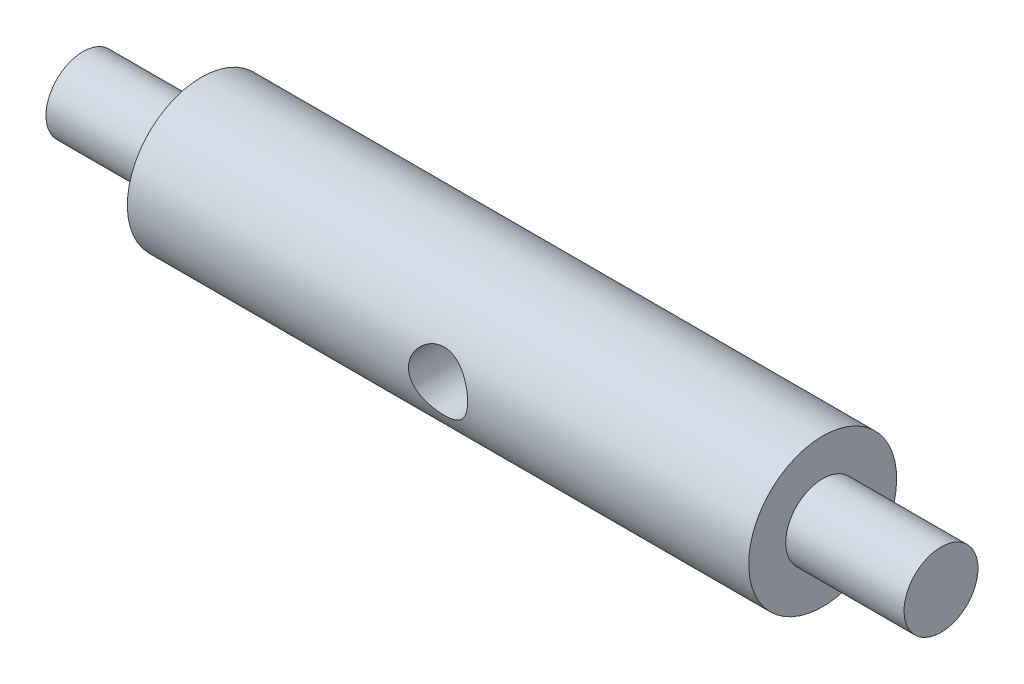
ISO-10303-21;
HEADER;
FILE_DESCRIPTION(('STEP AP214'),'2;1');
FILE_NAME('part.step','',(''),(''),'','','');
FILE_SCHEMA(('AUTOMOTIVE_DESIGN { 1 0 10303 214 1 1 1 1 }'));
ENDSEC;
DATA;
#1=APPLICATION_CONTEXT('core data for automotive mechanical design processes');
#2=APPLICATION_PROTOCOL_DEFINITION('international standard','automotive_design',2000,#1);
#3=PRODUCT_CONTEXT('',#1,'mechanical');
#4=PRODUCT('Part','Part','',(#3));
#5=PRODUCT_RELATED_PRODUCT_CATEGORY('part','',(#4));
#6=PRODUCT_DEFINITION_FORMATION('','',#4);
#7=PRODUCT_DEFINITION_CONTEXT('part definition',#1,'design');
#8=PRODUCT_DEFINITION('design','',#6,#7);
#9=PRODUCT_DEFINITION_SHAPE('','',#8);
#10=(LENGTH_UNIT() NAMED_UNIT(*) SI_UNIT(.MILLI.,.METRE.));
#11=(NAMED_UNIT(*) PLANE_ANGLE_UNIT() SI_UNIT($,.RADIAN.));
#12=(NAMED_UNIT(*) SI_UNIT($,.STERADIAN.) SOLID_ANGLE_UNIT());
#13=UNCERTAINTY_MEASURE_WITH_UNIT(LENGTH_MEASURE(1.E-05),#10,'distance_accuracy_value','');
#14=(GEOMETRIC_REPRESENTATION_CONTEXT(3) GLOBAL_UNCERTAINTY_ASSIGNED_CONTEXT((#13)) GLOBAL_UNIT_ASSIGNED_CONTEXT((#10,
#11,#12)) REPRESENTATION_CONTEXT('',''));
#15=CARTESIAN_POINT('',(0.,0.,0.));
#16=DIRECTION('',(0.,0.,1.));
#17=DIRECTION('',(1.,0.,0.));
#18=AXIS2_PLACEMENT_3D('',#15,#16,#17);
#19=CARTESIAN_POINT('',(-29.,0.,0.));
#20=DIRECTION('',(-1.,0.,0.));
#21=DIRECTION('',(0.,-1.,0.));
#22=AXIS2_PLACEMENT_3D('',#19,#20,#21);
#23=PLANE('',#22);
#24=CARTESIAN_POINT('',(-29.,0.,0.));
#25=DIRECTION('',(1.,0.,0.));
#26=DIRECTION('',(0.,1.,0.));
#27=AXIS2_PLACEMENT_3D('',#24,#25,#26);
#28=CIRCLE('',#27,2.5);
#29=CARTESIAN_POINT('',(-29.,2.5,0.));
#30=VERTEX_POINT('',#29);
#31=EDGE_CURVE('E10',#30,#30,#28,.T.);
#32=ORIENTED_EDGE('',*,*,#31,.F.);
#33=EDGE_LOOP('',(#32));
#34=FACE_BOUND('',#33,.T.);
#35=ADVANCED_FACE('F32',(#34),#23,.T.);
#36=CARTESIAN_POINT('',(29.,0.,0.));
#37=DIRECTION('',(1.,0.,0.));
#38=DIRECTION('',(0.,1.,0.));
#39=AXIS2_PLACEMENT_3D('',#36,#37,#38);
#40=CYLINDRICAL_SURFACE('',#39,2.5);
#41=ORIENTED_EDGE('',*,*,#31,.T.);
#42=EDGE_LOOP('',(#41));
#43=FACE_BOUND('',#42,.T.);
#44=CARTESIAN_POINT('',(-21.,0.,0.));
#45=DIRECTION('',(1.,0.,0.));
#46=DIRECTION('',(0.,1.,0.));
#47=AXIS2_PLACEMENT_3D('',#44,#45,#46);
#48=CIRCLE('',#47,2.5);
#49=CARTESIAN_POINT('',(-21.,2.5,0.));
#50=VERTEX_POINT('',#49);
#51=EDGE_CURVE('E43',#50,#50,#48,.T.);
#52=ORIENTED_EDGE('',*,*,#51,.F.);
#53=EDGE_LOOP('',(#52));
#54=FACE_BOUND('',#53,.T.);
#55=ADVANCED_FACE('F83',(#43,#54),#40,.T.);
#56=CARTESIAN_POINT('',(-21.,2.5,0.));
#57=DIRECTION('',(-1.,0.,0.));
#58=DIRECTION('',(0.,-1.,0.));
#59=AXIS2_PLACEMENT_3D('',#56,#57,#58);
#60=PLANE('',#59);
#61=ORIENTED_EDGE('',*,*,#51,.T.);
#62=EDGE_LOOP('',(#61));
#63=FACE_BOUND('',#62,.T.);
#64=CARTESIAN_POINT('',(-21.,0.,0.));
#65=DIRECTION('',(1.,0.,0.));
#66=DIRECTION('',(0.,1.,0.));
#67=AXIS2_PLACEMENT_3D('',#64,#65,#66);
#68=CIRCLE('',#67,5.);
#69=CARTESIAN_POINT('',(-21.,5.,0.));
#70=VERTEX_POINT('',#69);
#71=EDGE_CURVE('E48',#70,#70,#68,.T.);
#72=ORIENTED_EDGE('',*,*,#71,.F.);
#73=EDGE_LOOP('',(#72));
#74=FACE_BOUND('',#73,.T.);
#75=ADVANCED_FACE('F78',(#63,#74),#60,.T.);
#76=CARTESIAN_POINT('',(29.,0.,0.));
#77=DIRECTION('',(1.,0.,0.));
#78=DIRECTION('',(0.,1.,0.));
#79=AXIS2_PLACEMENT_3D('',#76,#77,#78);
#80=CYLINDRICAL_SURFACE('',#79,5.);
#81=CARTESIAN_POINT('',(2.,0.,-5.));
#82=CARTESIAN_POINT('',(1.99999014817627,-0.107493005442891,-4.99999271227084));
#83=CARTESIAN_POINT('',(1.99128224791162,-0.215172564090673,-4.99649294306932));
#84=CARTESIAN_POINT('',(1.95675229647876,-0.427496480417896,-4.98283453100641));
#85=CARTESIAN_POINT('',(1.93088372091387,-0.532131777561248,-4.97265778698877));
#86=CARTESIAN_POINT('',(1.86312392194117,-0.734953922727403,-4.94674209213118));
#87=CARTESIAN_POINT('',(1.82128515378327,-0.833160661616959,-4.93102136364072));
#88=CARTESIAN_POINT('',(1.72298082667345,-1.02107197032837,-4.89556610796078));
#89=CARTESIAN_POINT('',(1.66652034508107,-1.11077947675099,-4.87583297458056));
#90=CARTESIAN_POINT('',(1.53776450143906,-1.28350100757039,-4.83330886170418));
#91=CARTESIAN_POINT('',(1.46489334375974,-1.36606227255021,-4.8104229692919));
#92=CARTESIAN_POINT('',(1.30659999652322,-1.51817500478472,-4.76460576906194));
#93=CARTESIAN_POINT('',(1.22117170278826,-1.58772010713353,-4.74167444453792));
#94=CARTESIAN_POINT('',(1.03557192975773,-1.71487456729288,-4.69722791797136));
#95=CARTESIAN_POINT('',(0.934913513976802,-1.77181498119547,-4.67582115964951));
#96=CARTESIAN_POINT('',(0.724463601579957,-1.86775471903715,-4.63833647186792));
#97=CARTESIAN_POINT('',(0.614676472151639,-1.90676256428583,-4.62225601244176));
#98=CARTESIAN_POINT('',(0.394287666407897,-1.96389882339587,-4.59826357660818));
#99=CARTESIAN_POINT('',(0.283948764423786,-1.98289396580565,-4.59001420355605));
#100=CARTESIAN_POINT('',(0.0613650016927319,-2.00217296164003,-4.58164004049144));
#101=CARTESIAN_POINT('',(-0.0508788946250153,-2.00246601631322,-4.58151125522768));
#102=CARTESIAN_POINT('',(-0.265756671458044,-1.98498936750454,-4.58910500279994));
#103=CARTESIAN_POINT('',(-0.368515714409031,-1.96847531430514,-4.5962817503845));
#104=CARTESIAN_POINT('',(-0.569659556006714,-1.91994688029782,-4.61676187607836));
#105=CARTESIAN_POINT('',(-0.668043588110308,-1.88792979480463,-4.63006632321673));
#106=CARTESIAN_POINT('',(-0.860017836196042,-1.80869473255107,-4.6615948508853));
#107=CARTESIAN_POINT('',(-0.953469239054691,-1.76117986231532,-4.67991379280787));
#108=CARTESIAN_POINT('',(-1.13141581636156,-1.65250646073221,-4.7193811638989));
#109=CARTESIAN_POINT('',(-1.21590760940281,-1.59134280510084,-4.74053065456848));
#110=CARTESIAN_POINT('',(-1.380409728802,-1.45155059945443,-4.7852673674227));
#111=CARTESIAN_POINT('',(-1.45956872944602,-1.37193746297063,-4.80891664976151));
#112=CARTESIAN_POINT('',(-1.60368447800204,-1.20031442743019,-4.85459824958282));
#113=CARTESIAN_POINT('',(-1.66863839741029,-1.10830206533443,-4.87663024445324));
#114=CARTESIAN_POINT('',(-1.78361744741583,-0.912077652605842,-4.91714681264548));
#115=CARTESIAN_POINT('',(-1.83332228119705,-0.807660491346476,-4.93555270095414));
#116=CARTESIAN_POINT('',(-1.91416786107806,-0.591023765482881,-4.96614828328759));
#117=CARTESIAN_POINT('',(-1.94531803755741,-0.478808196849673,-4.97834113462382));
#118=CARTESIAN_POINT('',(-1.9864482954197,-0.256895887607819,-4.9945613950691));
#119=CARTESIAN_POINT('',(-1.99757245425356,-0.147443293985534,-4.99902945833514));
#120=CARTESIAN_POINT('',(-2.00171310052861,0.0718453098078176,-5.00068478510631));
#121=CARTESIAN_POINT('',(-1.99473428154751,0.181681213223924,-4.99787393582291));
#122=CARTESIAN_POINT('',(-1.96370824744801,0.393432739121988,-4.98557567063753));
#123=CARTESIAN_POINT('',(-1.94044201964902,0.495482491775475,-4.97639391345523));
#124=CARTESIAN_POINT('',(-1.87856429169019,0.694135428060781,-4.952594414055));
#125=CARTESIAN_POINT('',(-1.83995082033132,0.790737910224845,-4.9379759735653));
#126=CARTESIAN_POINT('',(-1.74721506032005,0.979078785816703,-4.90416594770811));
#127=CARTESIAN_POINT('',(-1.69265452795685,1.07057802275541,-4.88484815979803));
#128=CARTESIAN_POINT('',(-1.57005967609436,1.24344359124656,-4.84373364745524));
#129=CARTESIAN_POINT('',(-1.50201995707738,1.32480584076113,-4.8219359311027));
#130=CARTESIAN_POINT('',(-1.34912998705037,1.48072304302882,-4.77645117638112));
#131=CARTESIAN_POINT('',(-1.26346645849379,1.55447393380606,-4.75273441425052));
#132=CARTESIAN_POINT('',(-1.08055991699063,1.68675119741371,-4.70741672917132));
#133=CARTESIAN_POINT('',(-0.983314999660051,1.74527506133751,-4.68581615526511));
#134=CARTESIAN_POINT('',(-0.778538305405894,1.84580750193163,-4.64714299907708));
#135=CARTESIAN_POINT('',(-0.670916000787688,1.88765059453445,-4.63011630884787));
#136=CARTESIAN_POINT('',(-0.449266348284843,1.9522962197053,-4.60323673477931));
#137=CARTESIAN_POINT('',(-0.335243794187573,1.97511280526932,-4.59337855695998));
#138=CARTESIAN_POINT('',(-0.112872098225456,1.9997156172784,-4.58271759299926));
#139=CARTESIAN_POINT('',(-0.00470516040664804,2.00289708230287,-4.58131421008171));
#140=CARTESIAN_POINT('',(0.210544857713294,1.99180315927752,-4.58614836033098));
#141=CARTESIAN_POINT('',(0.317628073902585,1.97752998791378,-4.59238492324793));
#142=CARTESIAN_POINT('',(0.523332189855042,1.93307136615365,-4.6112664907902));
#143=CARTESIAN_POINT('',(0.622120274432999,1.90353749357098,-4.62364831827449));
#144=CARTESIAN_POINT('',(0.813378629613483,1.83000544849101,-4.65324001232696));
#145=CARTESIAN_POINT('',(0.905847146899827,1.78600328139381,-4.67045121206006));
#146=CARTESIAN_POINT('',(1.08760961927078,1.68187276275973,-4.70898609604491));
#147=CARTESIAN_POINT('',(1.17641867013048,1.62096533515949,-4.73048882313242));
#148=CARTESIAN_POINT('',(1.34299331720376,1.48589211927149,-4.77463804372237));
#149=CARTESIAN_POINT('',(1.42075557212832,1.41172233481812,-4.79728488048406));
#150=CARTESIAN_POINT('',(1.56820285326362,1.24650550627246,-4.84293567087394));
#151=CARTESIAN_POINT('',(1.63703730689807,1.15467600114614,-4.86586757962185));
#152=CARTESIAN_POINT('',(1.75833704262164,0.959900320285778,-4.90800406713717));
#153=CARTESIAN_POINT('',(1.81079471215253,0.856949004547236,-4.92720691092906));
#154=CARTESIAN_POINT('',(1.89662221519029,0.644738062495203,-4.95939714815861));
#155=CARTESIAN_POINT('',(1.93032932356034,0.535631618219696,-4.97249363055028));
#156=CARTESIAN_POINT('',(1.97863912095427,0.31287654628122,-4.99144306209365));
#157=CARTESIAN_POINT('',(1.9933024367439,0.199243525858912,-4.99731899495637));
#158=CARTESIAN_POINT('',(1.99939538097827,0.0569122978909289,-4.99975899504136));
#159=CARTESIAN_POINT('',(2.00000260862919,0.028462688740758,-5.00000192969175));
#160=CARTESIAN_POINT('',(2.,0.,-5.));
#161=B_SPLINE_CURVE_WITH_KNOTS('',3,(#81,#82,#83,#84,#85,#86,#87,#88,#89,#90,#91,#92,#93,#94,
#95,#96,#97,#98,#99,#100,#101,#102,#103,#104,#105,#106,#107,#108,#109,#110,#111,#112,#113,#114,
#115,#116,#117,#118,#119,#120,#121,#122,#123,#124,#125,#126,#127,#128,#129,#130,#131,#132,#133,
#134,#135,#136,#137,#138,#139,#140,#141,#142,#143,#144,#145,#146,#147,#148,#149,#150,#151,#152,
#153,#154,#155,#156,#157,#158,#159,#160),.UNSPECIFIED.,.T.,.F.,(4,2,2,2,2,2,2,2,2,2,2,2,2,2,2,2,
2,2,2,2,2,2,2,2,2,2,2,2,2,2,2,2,2,2,2,2,2,2,2,4),(0.,0.322402987893071,0.645683636007934,
0.967911457471581,1.29002753567984,1.62597381700397,1.96208394934411,2.31315258819217,
2.66405423118268,2.99904105308829,3.33386306340488,3.64538328401372,3.95695787256047,
4.27489126298816,4.59294421938183,4.93558349186557,5.27829092839733,5.62776913162806,
5.9770695611379,6.30569184528007,6.63422893570082,6.94800455564365,7.26182048993796,
7.58523513398262,7.90877959498969,8.25368474624413,8.59864669043748,8.94695045140828,
9.29499672645934,9.61799673392748,9.94095572563045,10.2511431854877,10.5614163580516,
10.8894546805669,11.2175920134839,11.5670042353384,11.9165786364053,12.2596430101332,
12.6016125240434,12.686980458968),.UNSPECIFIED.);
#162=CARTESIAN_POINT('',(2.,0.,-5.));
#163=VERTEX_POINT('',#162);
#164=EDGE_CURVE('E35',#163,#163,#161,.T.);
#165=ORIENTED_EDGE('',*,*,#164,.F.);
#166=EDGE_LOOP('',(#165));
#167=FACE_BOUND('',#166,.T.);
#168=CARTESIAN_POINT('',(2.,0.,5.));
#169=CARTESIAN_POINT('',(1.99999014817627,0.107493005442891,4.99999271227084));
#170=CARTESIAN_POINT('',(1.99128224791162,0.215172564090674,4.99649294306932));
#171=CARTESIAN_POINT('',(1.95675229647876,0.427496480417896,4.98283453100641));
#172=CARTESIAN_POINT('',(1.93088372091387,0.532131777561248,4.97265778698877));
#173=CARTESIAN_POINT('',(1.86312392194117,0.734953922727403,4.94674209213118));
#174=CARTESIAN_POINT('',(1.82128515378327,0.833160661616959,4.93102136364072));
#175=CARTESIAN_POINT('',(1.72298082667345,1.02107197032837,4.89556610796078));
#176=CARTESIAN_POINT('',(1.66652034508107,1.11077947675099,4.87583297458056));
#177=CARTESIAN_POINT('',(1.53776450143906,1.28350100757039,4.83330886170418));
#178=CARTESIAN_POINT('',(1.46489334375973,1.36606227255021,4.8104229692919));
#179=CARTESIAN_POINT('',(1.30659999652322,1.51817500478472,4.76460576906194));
#180=CARTESIAN_POINT('',(1.22117170278826,1.58772010713353,4.74167444453792));
#181=CARTESIAN_POINT('',(1.03557192975773,1.71487456729288,4.69722791797136));
#182=CARTESIAN_POINT('',(0.934913513976802,1.77181498119547,4.67582115964951));
#183=CARTESIAN_POINT('',(0.724463601579957,1.86775471903715,4.63833647186792));
#184=CARTESIAN_POINT('',(0.614676472151639,1.90676256428583,4.62225601244176));
#185=CARTESIAN_POINT('',(0.394287666407897,1.96389882339587,4.59826357660818));
#186=CARTESIAN_POINT('',(0.283948764423786,1.98289396580565,4.59001420355605));
#187=CARTESIAN_POINT('',(0.0613650016927319,2.00217296164003,4.58164004049144));
#188=CARTESIAN_POINT('',(-0.0508788946250153,2.00246601631322,4.58151125522768));
#189=CARTESIAN_POINT('',(-0.265756671458044,1.98498936750454,4.58910500279994));
#190=CARTESIAN_POINT('',(-0.368515714409031,1.96847531430514,4.5962817503845));
#191=CARTESIAN_POINT('',(-0.569659556006714,1.91994688029782,4.61676187607836));
#192=CARTESIAN_POINT('',(-0.668043588110308,1.88792979480463,4.63006632321673));
#193=CARTESIAN_POINT('',(-0.860017836196042,1.80869473255107,4.6615948508853));
#194=CARTESIAN_POINT('',(-0.953469239054691,1.76117986231532,4.67991379280787));
#195=CARTESIAN_POINT('',(-1.13141581636156,1.65250646073221,4.7193811638989));
#196=CARTESIAN_POINT('',(-1.21590760940281,1.59134280510084,4.74053065456848));
#197=CARTESIAN_POINT('',(-1.380409728802,1.45155059945443,4.7852673674227));
#198=CARTESIAN_POINT('',(-1.45956872944602,1.37193746297063,4.80891664976151));
#199=CARTESIAN_POINT('',(-1.60368447800204,1.20031442743019,4.85459824958282));
#200=CARTESIAN_POINT('',(-1.66863839741029,1.10830206533443,4.87663024445324));
#201=CARTESIAN_POINT('',(-1.78361744741583,0.912077652605842,4.91714681264548));
#202=CARTESIAN_POINT('',(-1.83332228119705,0.807660491346477,4.93555270095414));
#203=CARTESIAN_POINT('',(-1.91416786107806,0.591023765482881,4.96614828328759));
#204=CARTESIAN_POINT('',(-1.94531803755741,0.478808196849673,4.97834113462382));
#205=CARTESIAN_POINT('',(-1.9864482954197,0.256895887607819,4.9945613950691));
#206=CARTESIAN_POINT('',(-1.99757245425356,0.147443293985534,4.99902945833514));
#207=CARTESIAN_POINT('',(-2.00171310052861,-0.0718453098078179,5.00068478510631));
#208=CARTESIAN_POINT('',(-1.99473428154751,-0.181681213223924,4.99787393582291));
#209=CARTESIAN_POINT('',(-1.96370824744801,-0.393432739121988,4.98557567063753));
#210=CARTESIAN_POINT('',(-1.94044201964902,-0.495482491775475,4.97639391345523));
#211=CARTESIAN_POINT('',(-1.87856429169019,-0.694135428060781,4.952594414055));
#212=CARTESIAN_POINT('',(-1.83995082033132,-0.790737910224845,4.9379759735653));
#213=CARTESIAN_POINT('',(-1.74721506032005,-0.979078785816702,4.90416594770811));
#214=CARTESIAN_POINT('',(-1.69265452795685,-1.07057802275541,4.88484815979803));
#215=CARTESIAN_POINT('',(-1.57005967609436,-1.24344359124656,4.84373364745524));
#216=CARTESIAN_POINT('',(-1.50201995707739,-1.32480584076113,4.8219359311027));
#217=CARTESIAN_POINT('',(-1.34912998705037,-1.48072304302882,4.77645117638111));
#218=CARTESIAN_POINT('',(-1.26346645849379,-1.55447393380606,4.75273441425052));
#219=CARTESIAN_POINT('',(-1.08055991699063,-1.68675119741371,4.70741672917132));
#220=CARTESIAN_POINT('',(-0.983314999660051,-1.74527506133751,4.68581615526511));
#221=CARTESIAN_POINT('',(-0.778538305405894,-1.84580750193163,4.64714299907708));
#222=CARTESIAN_POINT('',(-0.670916000787689,-1.88765059453445,4.63011630884787));
#223=CARTESIAN_POINT('',(-0.449266348284844,-1.9522962197053,4.60323673477931));
#224=CARTESIAN_POINT('',(-0.335243794187574,-1.97511280526932,4.59337855695998));
#225=CARTESIAN_POINT('',(-0.112872098225457,-1.9997156172784,4.58271759299926));
#226=CARTESIAN_POINT('',(-0.00470516040664949,-2.00289708230287,4.58131421008171));
#227=CARTESIAN_POINT('',(0.210544857713293,-1.99180315927752,4.58614836033098));
#228=CARTESIAN_POINT('',(0.317628073902584,-1.97752998791378,4.59238492324793));
#229=CARTESIAN_POINT('',(0.523332189855042,-1.93307136615365,4.6112664907902));
#230=CARTESIAN_POINT('',(0.622120274432999,-1.90353749357098,4.62364831827449));
#231=CARTESIAN_POINT('',(0.813378629613482,-1.83000544849101,4.65324001232696));
#232=CARTESIAN_POINT('',(0.905847146899826,-1.78600328139381,4.67045121206006));
#233=CARTESIAN_POINT('',(1.08760961927078,-1.68187276275973,4.70898609604491));
#234=CARTESIAN_POINT('',(1.17641867013048,-1.62096533515949,4.73048882313242));
#235=CARTESIAN_POINT('',(1.34299331720375,-1.4858921192715,4.77463804372237));
#236=CARTESIAN_POINT('',(1.42075557212831,-1.41172233481812,4.79728488048406));
#237=CARTESIAN_POINT('',(1.56820285326362,-1.24650550627246,4.84293567087394));
#238=CARTESIAN_POINT('',(1.63703730689807,-1.15467600114614,4.86586757962185));
#239=CARTESIAN_POINT('',(1.75833704262164,-0.959900320285778,4.90800406713717));
#240=CARTESIAN_POINT('',(1.81079471215253,-0.856949004547237,4.92720691092906));
#241=CARTESIAN_POINT('',(1.89662221519029,-0.644738062495203,4.95939714815861));
#242=CARTESIAN_POINT('',(1.93032932356034,-0.535631618219696,4.97249363055028));
#243=CARTESIAN_POINT('',(1.97863912095427,-0.312876546281221,4.99144306209365));
#244=CARTESIAN_POINT('',(1.9933024367439,-0.199243525858912,4.99731899495637));
#245=CARTESIAN_POINT('',(1.99939538097827,-0.0569122978909294,4.99975899504136));
#246=CARTESIAN_POINT('',(2.00000260862919,-0.0284626887407582,5.00000192969175));
#247=CARTESIAN_POINT('',(2.,0.,5.));
#248=B_SPLINE_CURVE_WITH_KNOTS('',3,(#168,#169,#170,#171,#172,#173,#174,#175,#176,#177,#178,
#179,#180,#181,#182,#183,#184,#185,#186,#187,#188,#189,#190,#191,#192,#193,#194,#195,#196,#197,
#198,#199,#200,#201,#202,#203,#204,#205,#206,#207,#208,#209,#210,#211,#212,#213,#214,#215,#216,
#217,#218,#219,#220,#221,#222,#223,#224,#225,#226,#227,#228,#229,#230,#231,#232,#233,#234,#235,
#236,#237,#238,#239,#240,#241,#242,#243,#244,#245,#246,#247),.UNSPECIFIED.,.T.,.F.,(4,2,2,2,2,2,
2,2,2,2,2,2,2,2,2,2,2,2,2,2,2,2,2,2,2,2,2,2,2,2,2,2,2,2,2,2,2,2,2,4),(0.,0.322402987893071,
0.645683636007935,0.967911457471581,1.29002753567984,1.62597381700397,1.96208394934412,
2.31315258819217,2.66405423118268,2.99904105308829,3.33386306340488,3.64538328401372,
3.95695787256047,4.27489126298816,4.59294421938183,4.93558349186557,5.27829092839733,
5.62776913162806,5.9770695611379,6.30569184528007,6.63422893570082,6.94800455564365,
7.26182048993796,7.58523513398262,7.90877959498969,8.25368474624413,8.59864669043748,
8.94695045140827,9.29499672645934,9.61799673392748,9.94095572563045,10.2511431854877,
10.5614163580516,10.8894546805669,11.2175920134839,11.5670042353384,11.9165786364053,
12.2596430101332,12.6016125240434,12.686980458968),.UNSPECIFIED.);
#249=CARTESIAN_POINT('',(2.,0.,5.));
#250=VERTEX_POINT('',#249);
#251=EDGE_CURVE('E51',#250,#250,#248,.T.);
#252=ORIENTED_EDGE('',*,*,#251,.F.);
#253=EDGE_LOOP('',(#252));
#254=FACE_BOUND('',#253,.T.);
#255=ORIENTED_EDGE('',*,*,#71,.T.);
#256=EDGE_LOOP('',(#255));
#257=FACE_BOUND('',#256,.T.);
#258=CARTESIAN_POINT('',(21.,0.,0.));
#259=DIRECTION('',(1.,0.,0.));
#260=DIRECTION('',(0.,1.,0.));
#261=AXIS2_PLACEMENT_3D('',#258,#259,#260);
#262=CIRCLE('',#261,4.99999999999999);
#263=CARTESIAN_POINT('',(21.,5.,0.));
#264=VERTEX_POINT('',#263);
#265=EDGE_CURVE('E98',#264,#264,#262,.T.);
#266=ORIENTED_EDGE('',*,*,#265,.F.);
#267=EDGE_LOOP('',(#266));
#268=FACE_BOUND('',#267,.T.);
#269=ADVANCED_FACE('F55',(#167,#254,#257,#268),#80,.T.);
#270=CARTESIAN_POINT('',(21.,5.,0.));
#271=DIRECTION('',(1.,0.,0.));
#272=DIRECTION('',(0.,1.,0.));
#273=AXIS2_PLACEMENT_3D('',#270,#271,#272);
#274=PLANE('',#273);
#275=ORIENTED_EDGE('',*,*,#265,.T.);
#276=EDGE_LOOP('',(#275));
#277=FACE_BOUND('',#276,.T.);
#278=CARTESIAN_POINT('',(21.,0.,0.));
#279=DIRECTION('',(1.,0.,0.));
#280=DIRECTION('',(0.,1.,0.));
#281=AXIS2_PLACEMENT_3D('',#278,#279,#280);
#282=CIRCLE('',#281,2.49999999999999);
#283=CARTESIAN_POINT('',(21.,2.5,0.));
#284=VERTEX_POINT('',#283);
#285=EDGE_CURVE('E99',#284,#284,#282,.T.);
#286=ORIENTED_EDGE('',*,*,#285,.F.);
#287=EDGE_LOOP('',(#286));
#288=FACE_BOUND('',#287,.T.);
#289=ADVANCED_FACE('F71',(#277,#288),#274,.T.);
#290=CARTESIAN_POINT('',(29.,0.,0.));
#291=DIRECTION('',(1.,0.,0.));
#292=DIRECTION('',(0.,1.,0.));
#293=AXIS2_PLACEMENT_3D('',#290,#291,#292);
#294=CYLINDRICAL_SURFACE('',#293,2.49999999999999);
#295=ORIENTED_EDGE('',*,*,#285,.T.);
#296=EDGE_LOOP('',(#295));
#297=FACE_BOUND('',#296,.T.);
#298=CARTESIAN_POINT('',(29.,0.,0.));
#299=DIRECTION('',(1.,0.,0.));
#300=DIRECTION('',(0.,1.,0.));
#301=AXIS2_PLACEMENT_3D('',#298,#299,#300);
#302=CIRCLE('',#301,2.49999999999999);
#303=CARTESIAN_POINT('',(29.,2.5,0.));
#304=VERTEX_POINT('',#303);
#305=EDGE_CURVE('E104',#304,#304,#302,.T.);
#306=ORIENTED_EDGE('',*,*,#305,.F.);
#307=EDGE_LOOP('',(#306));
#308=FACE_BOUND('',#307,.T.);
#309=ADVANCED_FACE('F68',(#297,#308),#294,.T.);
#310=CARTESIAN_POINT('',(29.,2.5,0.));
#311=DIRECTION('',(1.,0.,0.));
#312=DIRECTION('',(0.,1.,0.));
#313=AXIS2_PLACEMENT_3D('',#310,#311,#312);
#314=PLANE('',#313);
#315=ORIENTED_EDGE('',*,*,#305,.T.);
#316=EDGE_LOOP('',(#315));
#317=FACE_BOUND('',#316,.T.);
#318=ADVANCED_FACE('F63',(#317),#314,.T.);
#319=CARTESIAN_POINT('',(0.,0.,-10.));
#320=DIRECTION('',(0.,0.,1.));
#321=DIRECTION('',(1.,0.,0.));
#322=AXIS2_PLACEMENT_3D('',#319,#320,#321);
#323=CYLINDRICAL_SURFACE('',#322,2.);
#324=ORIENTED_EDGE('',*,*,#164,.T.);
#325=EDGE_LOOP('',(#324));
#326=FACE_BOUND('',#325,.T.);
#327=ORIENTED_EDGE('',*,*,#251,.T.);
#328=EDGE_LOOP('',(#327));
#329=FACE_BOUND('',#328,.T.);
#330=ADVANCED_FACE('F59',(#326,#329),#323,.F.);
#331=CLOSED_SHELL('',(#35,#55,#75,#269,#289,#309,#318,#330));
#332=MANIFOLD_SOLID_BREP('B2',#331);
#333=ADVANCED_BREP_SHAPE_REPRESENTATION('',(#18,#332),#14);
#334=SHAPE_DEFINITION_REPRESENTATION(#9,#333);
ENDSEC;
END-ISO-10303-21;
